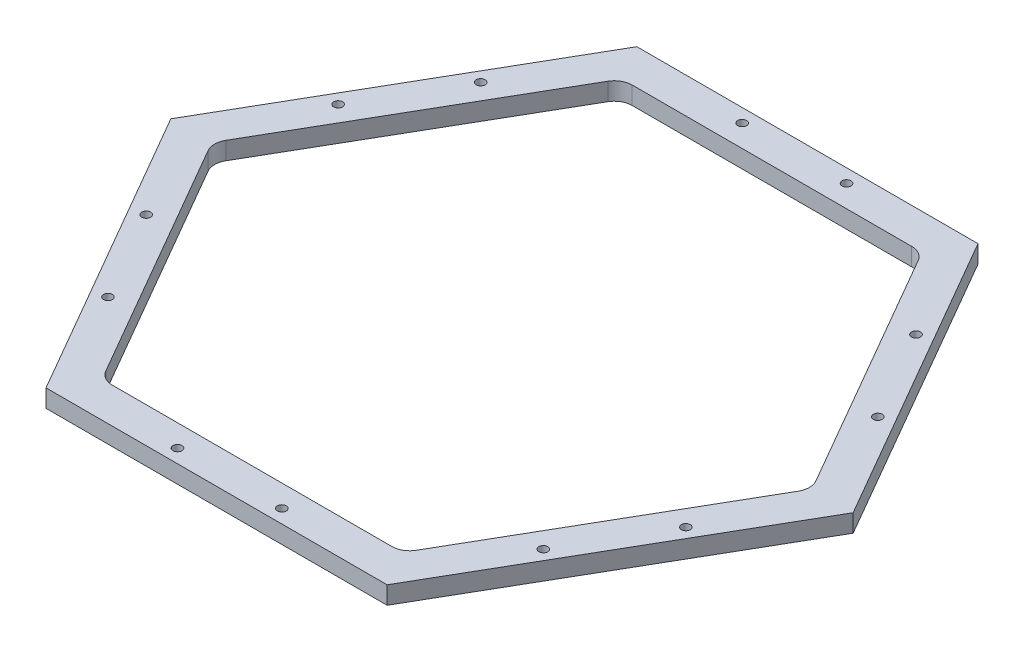
ISO-10303-21;
HEADER;
FILE_DESCRIPTION(('STEP AP214'),'2;1');
FILE_NAME('part.step','',(''),(''),'','','');
FILE_SCHEMA(('AUTOMOTIVE_DESIGN { 1 0 10303 214 1 1 1 1 }'));
ENDSEC;
DATA;
#1=APPLICATION_CONTEXT('core data for automotive mechanical design processes');
#2=APPLICATION_PROTOCOL_DEFINITION('international standard','automotive_design',2000,#1);
#3=PRODUCT_CONTEXT('',#1,'mechanical');
#4=PRODUCT('Part','Part','',(#3));
#5=PRODUCT_RELATED_PRODUCT_CATEGORY('part','',(#4));
#6=PRODUCT_DEFINITION_FORMATION('','',#4);
#7=PRODUCT_DEFINITION_CONTEXT('part definition',#1,'design');
#8=PRODUCT_DEFINITION('design','',#6,#7);
#9=PRODUCT_DEFINITION_SHAPE('','',#8);
#10=(LENGTH_UNIT() NAMED_UNIT(*) SI_UNIT(.MILLI.,.METRE.));
#11=(NAMED_UNIT(*) PLANE_ANGLE_UNIT() SI_UNIT($,.RADIAN.));
#12=(NAMED_UNIT(*) SI_UNIT($,.STERADIAN.) SOLID_ANGLE_UNIT());
#13=UNCERTAINTY_MEASURE_WITH_UNIT(LENGTH_MEASURE(1.E-05),#10,'distance_accuracy_value','');
#14=(GEOMETRIC_REPRESENTATION_CONTEXT(3) GLOBAL_UNCERTAINTY_ASSIGNED_CONTEXT((#13)) GLOBAL_UNIT_ASSIGNED_CONTEXT((#10,
#11,#12)) REPRESENTATION_CONTEXT('',''));
#15=CARTESIAN_POINT('',(0.,0.,0.));
#16=DIRECTION('',(0.,0.,1.));
#17=DIRECTION('',(1.,0.,0.));
#18=AXIS2_PLACEMENT_3D('',#15,#16,#17);
#19=CARTESIAN_POINT('',(0.,3.175,0.));
#20=DIRECTION('',(0.,1.,0.));
#21=DIRECTION('',(0.,0.,1.));
#22=AXIS2_PLACEMENT_3D('',#19,#20,#21);
#23=PLANE('',#22);
#24=CARTESIAN_POINT('',(-38.9523593293957,3.175,-33.353004394834));
#25=DIRECTION('',(0.,1.,0.));
#26=DIRECTION('',(0.,0.,1.));
#27=AXIS2_PLACEMENT_3D('',#24,#25,#26);
#28=CIRCLE('',#27,0.799999999999988);
#29=CARTESIAN_POINT('',(-38.9523593293957,3.175,-32.5530043948341));
#30=VERTEX_POINT('',#29);
#31=EDGE_CURVE('E329',#30,#30,#28,.T.);
#32=ORIENTED_EDGE('',*,*,#31,.F.);
#33=EDGE_LOOP('',(#32));
#34=FACE_BOUND('',#33,.T.);
#35=CARTESIAN_POINT('',(-48.2837120382008,3.175,-17.1906273998387));
#36=DIRECTION('',(0.,1.,0.));
#37=DIRECTION('',(0.,0.,1.));
#38=AXIS2_PLACEMENT_3D('',#35,#36,#37);
#39=CIRCLE('',#38,0.799999999999988);
#40=CARTESIAN_POINT('',(-48.2837120382008,3.175,-16.3906273998387));
#41=VERTEX_POINT('',#40);
#42=EDGE_CURVE('E319',#41,#41,#39,.T.);
#43=ORIENTED_EDGE('',*,*,#42,.F.);
#44=EDGE_LOOP('',(#43));
#45=FACE_BOUND('',#44,.T.);
#46=CARTESIAN_POINT('',(-48.3607287631581,3.175,17.0572305191795));
#47=DIRECTION('',(0.,1.,0.));
#48=DIRECTION('',(0.,0.,1.));
#49=AXIS2_PLACEMENT_3D('',#46,#47,#48);
#50=CIRCLE('',#49,0.799999999999988);
#51=CARTESIAN_POINT('',(-48.3607287631581,3.175,17.8572305191795));
#52=VERTEX_POINT('',#51);
#53=EDGE_CURVE('E316',#52,#52,#50,.T.);
#54=ORIENTED_EDGE('',*,*,#53,.F.);
#55=EDGE_LOOP('',(#54));
#56=FACE_BOUND('',#55,.T.);
#57=CARTESIAN_POINT('',(-39.0293760543535,3.175,33.2196075141752));
#58=DIRECTION('',(0.,1.,0.));
#59=DIRECTION('',(0.,0.,1.));
#60=AXIS2_PLACEMENT_3D('',#57,#58,#59);
#61=CIRCLE('',#60,0.799999999999988);
#62=CARTESIAN_POINT('',(-39.0293760543535,3.175,34.0196075141751));
#63=VERTEX_POINT('',#62);
#64=EDGE_CURVE('E313',#63,#63,#61,.T.);
#65=ORIENTED_EDGE('',*,*,#64,.F.);
#66=EDGE_LOOP('',(#65));
#67=FACE_BOUND('',#66,.T.);
#68=CARTESIAN_POINT('',(-9.4083694337619,3.175,50.4102349140136));
#69=DIRECTION('',(0.,1.,0.));
#70=DIRECTION('',(0.,0.,1.));
#71=AXIS2_PLACEMENT_3D('',#68,#69,#70);
#72=CIRCLE('',#71,0.79999999999999);
#73=CARTESIAN_POINT('',(-9.4083694337619,3.175,51.2102349140135));
#74=VERTEX_POINT('',#73);
#75=EDGE_CURVE('E309',#74,#74,#72,.T.);
#76=ORIENTED_EDGE('',*,*,#75,.F.);
#77=EDGE_LOOP('',(#76));
#78=FACE_BOUND('',#77,.T.);
#79=CARTESIAN_POINT('',(9.25433598384783,3.175,50.4102349140137));
#80=DIRECTION('',(0.,1.,0.));
#81=DIRECTION('',(0.,0.,1.));
#82=AXIS2_PLACEMENT_3D('',#79,#80,#81);
#83=CIRCLE('',#82,0.79999999999999);
#84=CARTESIAN_POINT('',(9.25433598384783,3.175,51.2102349140137));
#85=VERTEX_POINT('',#84);
#86=EDGE_CURVE('E305',#85,#85,#83,.T.);
#87=ORIENTED_EDGE('',*,*,#86,.F.);
#88=EDGE_LOOP('',(#87));
#89=FACE_BOUND('',#88,.T.);
#90=CARTESIAN_POINT('',(38.9523593293959,3.175,33.3530043948338));
#91=DIRECTION('',(0.,1.,0.));
#92=DIRECTION('',(0.,0.,1.));
#93=AXIS2_PLACEMENT_3D('',#90,#91,#92);
#94=CIRCLE('',#93,0.799999999999988);
#95=CARTESIAN_POINT('',(38.9523593293959,3.175,34.1530043948338));
#96=VERTEX_POINT('',#95);
#97=EDGE_CURVE('E304',#96,#96,#94,.T.);
#98=ORIENTED_EDGE('',*,*,#97,.F.);
#99=EDGE_LOOP('',(#98));
#100=FACE_BOUND('',#99,.T.);
#101=CARTESIAN_POINT('',(48.283712038201,3.175,17.1906273998384));
#102=DIRECTION('',(0.,1.,0.));
#103=DIRECTION('',(0.,0.,1.));
#104=AXIS2_PLACEMENT_3D('',#101,#102,#103);
#105=CIRCLE('',#104,0.799999999999988);
#106=CARTESIAN_POINT('',(48.283712038201,3.175,17.9906273998384));
#107=VERTEX_POINT('',#106);
#108=EDGE_CURVE('E343',#107,#107,#105,.T.);
#109=ORIENTED_EDGE('',*,*,#108,.F.);
#110=EDGE_LOOP('',(#109));
#111=FACE_BOUND('',#110,.T.);
#112=CARTESIAN_POINT('',(48.360728763158,3.175,-17.0572305191798));
#113=DIRECTION('',(0.,1.,0.));
#114=DIRECTION('',(0.,0.,1.));
#115=AXIS2_PLACEMENT_3D('',#112,#113,#114);
#116=CIRCLE('',#115,0.799999999999988);
#117=CARTESIAN_POINT('',(48.360728763158,3.175,-16.2572305191799));
#118=VERTEX_POINT('',#117);
#119=EDGE_CURVE('E300',#118,#118,#116,.T.);
#120=ORIENTED_EDGE('',*,*,#119,.F.);
#121=EDGE_LOOP('',(#120));
#122=FACE_BOUND('',#121,.T.);
#123=CARTESIAN_POINT('',(39.0293760543533,3.175,-33.2196075141754));
#124=DIRECTION('',(0.,1.,0.));
#125=DIRECTION('',(0.,0.,1.));
#126=AXIS2_PLACEMENT_3D('',#123,#124,#125);
#127=CIRCLE('',#126,0.799999999999988);
#128=CARTESIAN_POINT('',(39.0293760543533,3.175,-32.4196075141754));
#129=VERTEX_POINT('',#128);
#130=EDGE_CURVE('E299',#129,#129,#127,.T.);
#131=ORIENTED_EDGE('',*,*,#130,.F.);
#132=EDGE_LOOP('',(#131));
#133=FACE_BOUND('',#132,.T.);
#134=CARTESIAN_POINT('',(9.4083694337619,3.175,-50.4102349140136));
#135=DIRECTION('',(0.,1.,0.));
#136=DIRECTION('',(0.,0.,1.));
#137=AXIS2_PLACEMENT_3D('',#134,#135,#136);
#138=CIRCLE('',#137,0.79999999999999);
#139=CARTESIAN_POINT('',(9.4083694337619,3.175,-49.6102349140136));
#140=VERTEX_POINT('',#139);
#141=EDGE_CURVE('E356',#140,#140,#138,.T.);
#142=ORIENTED_EDGE('',*,*,#141,.F.);
#143=EDGE_LOOP('',(#142));
#144=FACE_BOUND('',#143,.T.);
#145=CARTESIAN_POINT('',(-9.25433598384783,3.175,-50.4102349140137));
#146=DIRECTION('',(0.,1.,0.));
#147=DIRECTION('',(0.,0.,1.));
#148=AXIS2_PLACEMENT_3D('',#145,#146,#147);
#149=CIRCLE('',#148,0.79999999999999);
#150=CARTESIAN_POINT('',(-9.25433598384783,3.175,-49.6102349140137));
#151=VERTEX_POINT('',#150);
#152=EDGE_CURVE('E362',#151,#151,#149,.T.);
#153=ORIENTED_EDGE('',*,*,#152,.F.);
#154=EDGE_LOOP('',(#153));
#155=FACE_BOUND('',#154,.T.);
#156=DIRECTION('',(0.5,0.,-0.866025403784438));
#157=VECTOR('',#156,1.);
#158=CARTESIAN_POINT('',(30.4992613140312,3.175,52.8262701892219));
#159=LINE('',#158,#157);
#160=CARTESIAN_POINT('',(30.4992613140312,3.175,52.8262701892219));
#161=VERTEX_POINT('',#160);
#162=CARTESIAN_POINT('',(60.9985226280624,3.175,0.));
#163=VERTEX_POINT('',#162);
#164=EDGE_CURVE('E257',#161,#163,#159,.T.);
#165=ORIENTED_EDGE('',*,*,#164,.T.);
#166=DIRECTION('',(-0.5,0.,-0.866025403784439));
#167=VECTOR('',#166,1.);
#168=CARTESIAN_POINT('',(60.9985226280624,3.175,0.));
#169=LINE('',#168,#167);
#170=CARTESIAN_POINT('',(30.4992613140312,3.175,-52.8262701892219));
#171=VERTEX_POINT('',#170);
#172=EDGE_CURVE('E260',#163,#171,#169,.T.);
#173=ORIENTED_EDGE('',*,*,#172,.T.);
#174=DIRECTION('',(-1.,0.,0.));
#175=VECTOR('',#174,1.);
#176=CARTESIAN_POINT('',(30.4992613140312,3.175,-52.8262701892219));
#177=LINE('',#176,#175);
#178=CARTESIAN_POINT('',(-30.4992613140312,3.175,-52.8262701892219));
#179=VERTEX_POINT('',#178);
#180=EDGE_CURVE('E263',#171,#179,#177,.T.);
#181=ORIENTED_EDGE('',*,*,#180,.T.);
#182=DIRECTION('',(-0.5,0.,0.866025403784439));
#183=VECTOR('',#182,1.);
#184=CARTESIAN_POINT('',(-30.4992613140312,3.175,-52.8262701892219));
#185=LINE('',#184,#183);
#186=CARTESIAN_POINT('',(-60.9985226280624,3.175,0.));
#187=VERTEX_POINT('',#186);
#188=EDGE_CURVE('E265',#179,#187,#185,.T.);
#189=ORIENTED_EDGE('',*,*,#188,.T.);
#190=DIRECTION('',(0.5,0.,0.866025403784438));
#191=VECTOR('',#190,1.);
#192=CARTESIAN_POINT('',(-60.9985226280624,3.175,0.));
#193=LINE('',#192,#191);
#194=CARTESIAN_POINT('',(-30.4992613140312,3.175,52.8262701892219));
#195=VERTEX_POINT('',#194);
#196=EDGE_CURVE('E267',#187,#195,#193,.T.);
#197=ORIENTED_EDGE('',*,*,#196,.T.);
#198=DIRECTION('',(1.,0.,0.));
#199=VECTOR('',#198,1.);
#200=CARTESIAN_POINT('',(-30.4992613140312,3.175,52.8262701892219));
#201=LINE('',#200,#199);
#202=EDGE_CURVE('E269',#195,#161,#201,.T.);
#203=ORIENTED_EDGE('',*,*,#202,.T.);
#204=EDGE_LOOP('',(#165,#173,#181,#189,#197,#203));
#205=FACE_BOUND('',#204,.T.);
#206=DIRECTION('',(0.5,0.,0.866025403784438));
#207=VECTOR('',#206,1.);
#208=CARTESIAN_POINT('',(-52.7496306570156,3.175,1.58750000000003));
#209=LINE('',#208,#207);
#210=CARTESIAN_POINT('',(-52.7496306570156,3.175,1.58750000000003));
#211=VERTEX_POINT('',#210);
#212=CARTESIAN_POINT('',(-27.7496306570156,3.175,44.8887701892219));
#213=VERTEX_POINT('',#212);
#214=EDGE_CURVE('E170',#211,#213,#209,.T.);
#215=ORIENTED_EDGE('',*,*,#214,.F.);
#216=CARTESIAN_POINT('',(-50.,3.175,0.));
#217=DIRECTION('',(0.,1.,0.));
#218=DIRECTION('',(0.,0.,1.));
#219=AXIS2_PLACEMENT_3D('',#216,#217,#218);
#220=CIRCLE('',#219,3.17500000000001);
#221=CARTESIAN_POINT('',(-52.7496306570156,3.175,-1.58749999999998));
#222=VERTEX_POINT('',#221);
#223=EDGE_CURVE('E162',#222,#211,#220,.T.);
#224=ORIENTED_EDGE('',*,*,#223,.F.);
#225=DIRECTION('',(-0.5,0.,0.866025403784439));
#226=VECTOR('',#225,1.);
#227=CARTESIAN_POINT('',(-27.7496306570156,3.175,-44.8887701892219));
#228=LINE('',#227,#226);
#229=CARTESIAN_POINT('',(-27.7496306570156,3.175,-44.8887701892219));
#230=VERTEX_POINT('',#229);
#231=EDGE_CURVE('E204',#230,#222,#228,.T.);
#232=ORIENTED_EDGE('',*,*,#231,.F.);
#233=CARTESIAN_POINT('',(-25.,3.175,-43.3012701892219));
#234=DIRECTION('',(0.,1.,0.));
#235=DIRECTION('',(0.,0.,1.));
#236=AXIS2_PLACEMENT_3D('',#233,#234,#235);
#237=CIRCLE('',#236,3.175);
#238=CARTESIAN_POINT('',(-25.,3.175,-46.4762701892219));
#239=VERTEX_POINT('',#238);
#240=EDGE_CURVE('E202',#239,#230,#237,.T.);
#241=ORIENTED_EDGE('',*,*,#240,.F.);
#242=DIRECTION('',(-1.,0.,0.));
#243=VECTOR('',#242,1.);
#244=CARTESIAN_POINT('',(25.,3.175,-46.4762701892219));
#245=LINE('',#244,#243);
#246=CARTESIAN_POINT('',(25.,3.175,-46.4762701892219));
#247=VERTEX_POINT('',#246);
#248=EDGE_CURVE('E200',#247,#239,#245,.T.);
#249=ORIENTED_EDGE('',*,*,#248,.F.);
#250=CARTESIAN_POINT('',(25.,3.175,-43.3012701892219));
#251=DIRECTION('',(0.,1.,0.));
#252=DIRECTION('',(0.,0.,1.));
#253=AXIS2_PLACEMENT_3D('',#250,#251,#252);
#254=CIRCLE('',#253,3.175);
#255=CARTESIAN_POINT('',(27.7496306570156,3.175,-44.8887701892219));
#256=VERTEX_POINT('',#255);
#257=EDGE_CURVE('E198',#256,#247,#254,.T.);
#258=ORIENTED_EDGE('',*,*,#257,.F.);
#259=DIRECTION('',(-0.5,0.,-0.866025403784439));
#260=VECTOR('',#259,1.);
#261=CARTESIAN_POINT('',(52.7496306570156,3.175,-1.58750000000003));
#262=LINE('',#261,#260);
#263=CARTESIAN_POINT('',(52.7496306570156,3.175,-1.58750000000003));
#264=VERTEX_POINT('',#263);
#265=EDGE_CURVE('E196',#264,#256,#262,.T.);
#266=ORIENTED_EDGE('',*,*,#265,.F.);
#267=CARTESIAN_POINT('',(50.,3.175,0.));
#268=DIRECTION('',(0.,1.,0.));
#269=DIRECTION('',(0.,0.,-1.));
#270=AXIS2_PLACEMENT_3D('',#267,#268,#269);
#271=CIRCLE('',#270,3.175);
#272=CARTESIAN_POINT('',(52.7496306570156,3.175,1.58749999999997));
#273=VERTEX_POINT('',#272);
#274=EDGE_CURVE('E194',#273,#264,#271,.T.);
#275=ORIENTED_EDGE('',*,*,#274,.F.);
#276=DIRECTION('',(0.5,0.,-0.866025403784439));
#277=VECTOR('',#276,1.);
#278=CARTESIAN_POINT('',(27.7496306570156,3.175,44.8887701892219));
#279=LINE('',#278,#277);
#280=CARTESIAN_POINT('',(27.7496306570156,3.175,44.8887701892219));
#281=VERTEX_POINT('',#280);
#282=EDGE_CURVE('E192',#281,#273,#279,.T.);
#283=ORIENTED_EDGE('',*,*,#282,.F.);
#284=CARTESIAN_POINT('',(25.,3.175,43.3012701892219));
#285=DIRECTION('',(0.,1.,0.));
#286=DIRECTION('',(0.,0.,1.));
#287=AXIS2_PLACEMENT_3D('',#284,#285,#286);
#288=CIRCLE('',#287,3.175);
#289=CARTESIAN_POINT('',(25.,3.175,46.4762701892219));
#290=VERTEX_POINT('',#289);
#291=EDGE_CURVE('E190',#290,#281,#288,.T.);
#292=ORIENTED_EDGE('',*,*,#291,.F.);
#293=DIRECTION('',(1.,0.,0.));
#294=VECTOR('',#293,1.);
#295=CARTESIAN_POINT('',(-25.,3.175,46.4762701892219));
#296=LINE('',#295,#294);
#297=CARTESIAN_POINT('',(-25.,3.175,46.4762701892219));
#298=VERTEX_POINT('',#297);
#299=EDGE_CURVE('E185',#298,#290,#296,.T.);
#300=ORIENTED_EDGE('',*,*,#299,.F.);
#301=CARTESIAN_POINT('',(-25.,3.175,43.3012701892219));
#302=DIRECTION('',(0.,1.,0.));
#303=DIRECTION('',(0.,0.,1.));
#304=AXIS2_PLACEMENT_3D('',#301,#302,#303);
#305=CIRCLE('',#304,3.175);
#306=EDGE_CURVE('E183',#213,#298,#305,.T.);
#307=ORIENTED_EDGE('',*,*,#306,.F.);
#308=EDGE_LOOP('',(#215,#224,#232,#241,#249,#258,#266,#275,#283,#292,#300,#307));
#309=FACE_BOUND('',#308,.T.);
#310=ADVANCED_FACE('F35',(#34,#45,#56,#67,#78,#89,#100,#111,#122,#133,#144,#155,#205,#309),#23,.T.);
#311=CARTESIAN_POINT('',(0.,0.,0.));
#312=DIRECTION('',(0.,1.,0.));
#313=DIRECTION('',(0.,0.,1.));
#314=AXIS2_PLACEMENT_3D('',#311,#312,#313);
#315=PLANE('',#314);
#316=CARTESIAN_POINT('',(-38.9523593293957,0.,-33.353004394834));
#317=DIRECTION('',(0.,1.,0.));
#318=DIRECTION('',(0.,0.,1.));
#319=AXIS2_PLACEMENT_3D('',#316,#317,#318);
#320=CIRCLE('',#319,0.799999999999988);
#321=CARTESIAN_POINT('',(-38.9523593293957,0.,-32.5530043948341));
#322=VERTEX_POINT('',#321);
#323=EDGE_CURVE('E39',#322,#322,#320,.T.);
#324=ORIENTED_EDGE('',*,*,#323,.T.);
#325=EDGE_LOOP('',(#324));
#326=FACE_BOUND('',#325,.T.);
#327=CARTESIAN_POINT('',(-48.2837120382008,0.,-17.1906273998387));
#328=DIRECTION('',(0.,1.,0.));
#329=DIRECTION('',(0.,0.,1.));
#330=AXIS2_PLACEMENT_3D('',#327,#328,#329);
#331=CIRCLE('',#330,0.799999999999988);
#332=CARTESIAN_POINT('',(-48.2837120382008,0.,-16.3906273998387));
#333=VERTEX_POINT('',#332);
#334=EDGE_CURVE('E317',#333,#333,#331,.T.);
#335=ORIENTED_EDGE('',*,*,#334,.T.);
#336=EDGE_LOOP('',(#335));
#337=FACE_BOUND('',#336,.T.);
#338=CARTESIAN_POINT('',(-48.3607287631581,0.,17.0572305191795));
#339=DIRECTION('',(0.,1.,0.));
#340=DIRECTION('',(0.,0.,1.));
#341=AXIS2_PLACEMENT_3D('',#338,#339,#340);
#342=CIRCLE('',#341,0.799999999999988);
#343=CARTESIAN_POINT('',(-48.3607287631581,0.,17.8572305191795));
#344=VERTEX_POINT('',#343);
#345=EDGE_CURVE('E314',#344,#344,#342,.T.);
#346=ORIENTED_EDGE('',*,*,#345,.T.);
#347=EDGE_LOOP('',(#346));
#348=FACE_BOUND('',#347,.T.);
#349=CARTESIAN_POINT('',(-39.0293760543535,0.,33.2196075141752));
#350=DIRECTION('',(0.,1.,0.));
#351=DIRECTION('',(0.,0.,1.));
#352=AXIS2_PLACEMENT_3D('',#349,#350,#351);
#353=CIRCLE('',#352,0.799999999999988);
#354=CARTESIAN_POINT('',(-39.0293760543535,0.,34.0196075141751));
#355=VERTEX_POINT('',#354);
#356=EDGE_CURVE('E310',#355,#355,#353,.T.);
#357=ORIENTED_EDGE('',*,*,#356,.T.);
#358=EDGE_LOOP('',(#357));
#359=FACE_BOUND('',#358,.T.);
#360=CARTESIAN_POINT('',(-9.4083694337619,0.,50.4102349140136));
#361=DIRECTION('',(0.,1.,0.));
#362=DIRECTION('',(0.,0.,1.));
#363=AXIS2_PLACEMENT_3D('',#360,#361,#362);
#364=CIRCLE('',#363,0.799999999999989);
#365=CARTESIAN_POINT('',(-9.4083694337619,0.,51.2102349140135));
#366=VERTEX_POINT('',#365);
#367=EDGE_CURVE('E306',#366,#366,#364,.T.);
#368=ORIENTED_EDGE('',*,*,#367,.T.);
#369=EDGE_LOOP('',(#368));
#370=FACE_BOUND('',#369,.T.);
#371=CARTESIAN_POINT('',(9.25433598384783,0.,50.4102349140137));
#372=DIRECTION('',(0.,1.,0.));
#373=DIRECTION('',(0.,0.,1.));
#374=AXIS2_PLACEMENT_3D('',#371,#372,#373);
#375=CIRCLE('',#374,0.799999999999989);
#376=CARTESIAN_POINT('',(9.25433598384783,0.,51.2102349140137));
#377=VERTEX_POINT('',#376);
#378=EDGE_CURVE('E301',#377,#377,#375,.T.);
#379=ORIENTED_EDGE('',*,*,#378,.T.);
#380=EDGE_LOOP('',(#379));
#381=FACE_BOUND('',#380,.T.);
#382=CARTESIAN_POINT('',(38.9523593293959,0.,33.3530043948338));
#383=DIRECTION('',(0.,1.,0.));
#384=DIRECTION('',(0.,0.,1.));
#385=AXIS2_PLACEMENT_3D('',#382,#383,#384);
#386=CIRCLE('',#385,0.799999999999988);
#387=CARTESIAN_POINT('',(38.9523593293959,0.,34.1530043948338));
#388=VERTEX_POINT('',#387);
#389=EDGE_CURVE('E340',#388,#388,#386,.T.);
#390=ORIENTED_EDGE('',*,*,#389,.T.);
#391=EDGE_LOOP('',(#390));
#392=FACE_BOUND('',#391,.T.);
#393=CARTESIAN_POINT('',(48.283712038201,0.,17.1906273998384));
#394=DIRECTION('',(0.,1.,0.));
#395=DIRECTION('',(0.,0.,1.));
#396=AXIS2_PLACEMENT_3D('',#393,#394,#395);
#397=CIRCLE('',#396,0.799999999999988);
#398=CARTESIAN_POINT('',(48.283712038201,0.,17.9906273998384));
#399=VERTEX_POINT('',#398);
#400=EDGE_CURVE('E346',#399,#399,#397,.T.);
#401=ORIENTED_EDGE('',*,*,#400,.T.);
#402=EDGE_LOOP('',(#401));
#403=FACE_BOUND('',#402,.T.);
#404=CARTESIAN_POINT('',(48.360728763158,0.,-17.0572305191798));
#405=DIRECTION('',(0.,1.,0.));
#406=DIRECTION('',(0.,0.,1.));
#407=AXIS2_PLACEMENT_3D('',#404,#405,#406);
#408=CIRCLE('',#407,0.799999999999988);
#409=CARTESIAN_POINT('',(48.360728763158,0.,-16.2572305191799));
#410=VERTEX_POINT('',#409);
#411=EDGE_CURVE('E296',#410,#410,#408,.T.);
#412=ORIENTED_EDGE('',*,*,#411,.T.);
#413=EDGE_LOOP('',(#412));
#414=FACE_BOUND('',#413,.T.);
#415=CARTESIAN_POINT('',(39.0293760543533,0.,-33.2196075141754));
#416=DIRECTION('',(0.,1.,0.));
#417=DIRECTION('',(0.,0.,1.));
#418=AXIS2_PLACEMENT_3D('',#415,#416,#417);
#419=CIRCLE('',#418,0.799999999999988);
#420=CARTESIAN_POINT('',(39.0293760543533,0.,-32.4196075141754));
#421=VERTEX_POINT('',#420);
#422=EDGE_CURVE('E353',#421,#421,#419,.T.);
#423=ORIENTED_EDGE('',*,*,#422,.T.);
#424=EDGE_LOOP('',(#423));
#425=FACE_BOUND('',#424,.T.);
#426=CARTESIAN_POINT('',(9.4083694337619,0.,-50.4102349140136));
#427=DIRECTION('',(0.,1.,0.));
#428=DIRECTION('',(0.,0.,1.));
#429=AXIS2_PLACEMENT_3D('',#426,#427,#428);
#430=CIRCLE('',#429,0.799999999999989);
#431=CARTESIAN_POINT('',(9.4083694337619,0.,-49.6102349140136));
#432=VERTEX_POINT('',#431);
#433=EDGE_CURVE('E359',#432,#432,#430,.T.);
#434=ORIENTED_EDGE('',*,*,#433,.T.);
#435=EDGE_LOOP('',(#434));
#436=FACE_BOUND('',#435,.T.);
#437=CARTESIAN_POINT('',(-9.25433598384783,0.,-50.4102349140137));
#438=DIRECTION('',(0.,1.,0.));
#439=DIRECTION('',(0.,0.,1.));
#440=AXIS2_PLACEMENT_3D('',#437,#438,#439);
#441=CIRCLE('',#440,0.799999999999989);
#442=CARTESIAN_POINT('',(-9.25433598384783,0.,-49.6102349140137));
#443=VERTEX_POINT('',#442);
#444=EDGE_CURVE('E207',#443,#443,#441,.T.);
#445=ORIENTED_EDGE('',*,*,#444,.T.);
#446=EDGE_LOOP('',(#445));
#447=FACE_BOUND('',#446,.T.);
#448=DIRECTION('',(0.5,0.,-0.866025403784438));
#449=VECTOR('',#448,1.);
#450=CARTESIAN_POINT('',(30.4992613140312,0.,52.8262701892219));
#451=LINE('',#450,#449);
#452=CARTESIAN_POINT('',(30.4992613140312,0.,52.8262701892219));
#453=VERTEX_POINT('',#452);
#454=CARTESIAN_POINT('',(60.9985226280624,0.,0.));
#455=VERTEX_POINT('',#454);
#456=EDGE_CURVE('E178',#453,#455,#451,.T.);
#457=ORIENTED_EDGE('',*,*,#456,.F.);
#458=DIRECTION('',(1.,0.,0.));
#459=VECTOR('',#458,1.);
#460=CARTESIAN_POINT('',(-30.4992613140312,0.,52.8262701892219));
#461=LINE('',#460,#459);
#462=CARTESIAN_POINT('',(-30.4992613140312,0.,52.8262701892219));
#463=VERTEX_POINT('',#462);
#464=EDGE_CURVE('E261',#463,#453,#461,.T.);
#465=ORIENTED_EDGE('',*,*,#464,.F.);
#466=DIRECTION('',(0.5,0.,0.866025403784438));
#467=VECTOR('',#466,1.);
#468=CARTESIAN_POINT('',(-60.9985226280624,0.,0.));
#469=LINE('',#468,#467);
#470=CARTESIAN_POINT('',(-60.9985226280624,0.,0.));
#471=VERTEX_POINT('',#470);
#472=EDGE_CURVE('E280',#471,#463,#469,.T.);
#473=ORIENTED_EDGE('',*,*,#472,.F.);
#474=DIRECTION('',(-0.5,0.,0.866025403784439));
#475=VECTOR('',#474,1.);
#476=CARTESIAN_POINT('',(-30.4992613140312,0.,-52.8262701892219));
#477=LINE('',#476,#475);
#478=CARTESIAN_POINT('',(-30.4992613140312,0.,-52.8262701892219));
#479=VERTEX_POINT('',#478);
#480=EDGE_CURVE('E278',#479,#471,#477,.T.);
#481=ORIENTED_EDGE('',*,*,#480,.F.);
#482=DIRECTION('',(-1.,0.,0.));
#483=VECTOR('',#482,1.);
#484=CARTESIAN_POINT('',(30.4992613140312,0.,-52.8262701892219));
#485=LINE('',#484,#483);
#486=CARTESIAN_POINT('',(30.4992613140312,0.,-52.8262701892219));
#487=VERTEX_POINT('',#486);
#488=EDGE_CURVE('E276',#487,#479,#485,.T.);
#489=ORIENTED_EDGE('',*,*,#488,.F.);
#490=DIRECTION('',(-0.5,0.,-0.866025403784439));
#491=VECTOR('',#490,1.);
#492=CARTESIAN_POINT('',(60.9985226280624,0.,0.));
#493=LINE('',#492,#491);
#494=EDGE_CURVE('E274',#455,#487,#493,.T.);
#495=ORIENTED_EDGE('',*,*,#494,.F.);
#496=EDGE_LOOP('',(#457,#465,#473,#481,#489,#495));
#497=FACE_BOUND('',#496,.T.);
#498=CARTESIAN_POINT('',(-50.,0.,0.));
#499=DIRECTION('',(0.,1.,0.));
#500=DIRECTION('',(0.,0.,1.));
#501=AXIS2_PLACEMENT_3D('',#498,#499,#500);
#502=CIRCLE('',#501,3.17500000000001);
#503=CARTESIAN_POINT('',(-52.7496306570156,0.,-1.58749999999998));
#504=VERTEX_POINT('',#503);
#505=CARTESIAN_POINT('',(-52.7496306570156,0.,1.58750000000003));
#506=VERTEX_POINT('',#505);
#507=EDGE_CURVE('E60',#504,#506,#502,.T.);
#508=ORIENTED_EDGE('',*,*,#507,.T.);
#509=DIRECTION('',(0.5,0.,0.866025403784438));
#510=VECTOR('',#509,1.);
#511=CARTESIAN_POINT('',(-52.7496306570156,0.,1.58750000000003));
#512=LINE('',#511,#510);
#513=CARTESIAN_POINT('',(-27.7496306570156,0.,44.8887701892219));
#514=VERTEX_POINT('',#513);
#515=EDGE_CURVE('E177',#506,#514,#512,.T.);
#516=ORIENTED_EDGE('',*,*,#515,.T.);
#517=CARTESIAN_POINT('',(-25.,0.,43.3012701892219));
#518=DIRECTION('',(0.,1.,0.));
#519=DIRECTION('',(0.,0.,1.));
#520=AXIS2_PLACEMENT_3D('',#517,#518,#519);
#521=CIRCLE('',#520,3.175);
#522=CARTESIAN_POINT('',(-25.,0.,46.4762701892219));
#523=VERTEX_POINT('',#522);
#524=EDGE_CURVE('E209',#514,#523,#521,.T.);
#525=ORIENTED_EDGE('',*,*,#524,.T.);
#526=DIRECTION('',(1.,0.,0.));
#527=VECTOR('',#526,1.);
#528=CARTESIAN_POINT('',(-25.,0.,46.4762701892219));
#529=LINE('',#528,#527);
#530=CARTESIAN_POINT('',(25.,0.,46.4762701892219));
#531=VERTEX_POINT('',#530);
#532=EDGE_CURVE('E212',#523,#531,#529,.T.);
#533=ORIENTED_EDGE('',*,*,#532,.T.);
#534=CARTESIAN_POINT('',(25.,0.,43.3012701892219));
#535=DIRECTION('',(0.,1.,0.));
#536=DIRECTION('',(0.,0.,1.));
#537=AXIS2_PLACEMENT_3D('',#534,#535,#536);
#538=CIRCLE('',#537,3.175);
#539=CARTESIAN_POINT('',(27.7496306570156,0.,44.8887701892219));
#540=VERTEX_POINT('',#539);
#541=EDGE_CURVE('E215',#531,#540,#538,.T.);
#542=ORIENTED_EDGE('',*,*,#541,.T.);
#543=DIRECTION('',(0.5,0.,-0.866025403784439));
#544=VECTOR('',#543,1.);
#545=CARTESIAN_POINT('',(27.7496306570156,0.,44.8887701892219));
#546=LINE('',#545,#544);
#547=CARTESIAN_POINT('',(52.7496306570156,0.,1.58749999999997));
#548=VERTEX_POINT('',#547);
#549=EDGE_CURVE('E218',#540,#548,#546,.T.);
#550=ORIENTED_EDGE('',*,*,#549,.T.);
#551=CARTESIAN_POINT('',(50.,0.,0.));
#552=DIRECTION('',(0.,1.,0.));
#553=DIRECTION('',(0.,0.,-1.));
#554=AXIS2_PLACEMENT_3D('',#551,#552,#553);
#555=CIRCLE('',#554,3.175);
#556=CARTESIAN_POINT('',(52.7496306570156,0.,-1.58750000000003));
#557=VERTEX_POINT('',#556);
#558=EDGE_CURVE('E221',#548,#557,#555,.T.);
#559=ORIENTED_EDGE('',*,*,#558,.T.);
#560=DIRECTION('',(-0.5,0.,-0.866025403784439));
#561=VECTOR('',#560,1.);
#562=CARTESIAN_POINT('',(52.7496306570156,0.,-1.58750000000003));
#563=LINE('',#562,#561);
#564=CARTESIAN_POINT('',(27.7496306570156,0.,-44.8887701892219));
#565=VERTEX_POINT('',#564);
#566=EDGE_CURVE('E224',#557,#565,#563,.T.);
#567=ORIENTED_EDGE('',*,*,#566,.T.);
#568=CARTESIAN_POINT('',(25.,0.,-43.3012701892219));
#569=DIRECTION('',(0.,1.,0.));
#570=DIRECTION('',(0.,0.,1.));
#571=AXIS2_PLACEMENT_3D('',#568,#569,#570);
#572=CIRCLE('',#571,3.175);
#573=CARTESIAN_POINT('',(25.,0.,-46.4762701892219));
#574=VERTEX_POINT('',#573);
#575=EDGE_CURVE('E227',#565,#574,#572,.T.);
#576=ORIENTED_EDGE('',*,*,#575,.T.);
#577=DIRECTION('',(-1.,0.,0.));
#578=VECTOR('',#577,1.);
#579=CARTESIAN_POINT('',(25.,0.,-46.4762701892219));
#580=LINE('',#579,#578);
#581=CARTESIAN_POINT('',(-25.,0.,-46.4762701892219));
#582=VERTEX_POINT('',#581);
#583=EDGE_CURVE('E230',#574,#582,#580,.T.);
#584=ORIENTED_EDGE('',*,*,#583,.T.);
#585=CARTESIAN_POINT('',(-25.,0.,-43.3012701892219));
#586=DIRECTION('',(0.,1.,0.));
#587=DIRECTION('',(0.,0.,1.));
#588=AXIS2_PLACEMENT_3D('',#585,#586,#587);
#589=CIRCLE('',#588,3.175);
#590=CARTESIAN_POINT('',(-27.7496306570156,0.,-44.8887701892219));
#591=VERTEX_POINT('',#590);
#592=EDGE_CURVE('E233',#582,#591,#589,.T.);
#593=ORIENTED_EDGE('',*,*,#592,.T.);
#594=DIRECTION('',(-0.5,0.,0.866025403784439));
#595=VECTOR('',#594,1.);
#596=CARTESIAN_POINT('',(-27.7496306570156,0.,-44.8887701892219));
#597=LINE('',#596,#595);
#598=EDGE_CURVE('E171',#591,#504,#597,.T.);
#599=ORIENTED_EDGE('',*,*,#598,.T.);
#600=EDGE_LOOP('',(#508,#516,#525,#533,#542,#550,#559,#567,#576,#584,#593,#599));
#601=FACE_BOUND('',#600,.T.);
#602=ADVANCED_FACE('F367',(#326,#337,#348,#359,#370,#381,#392,#403,#414,#425,#436,#447,#497,
#601),#315,.F.);
#603=CARTESIAN_POINT('',(30.4992613140312,3.175,52.8262701892219));
#604=DIRECTION('',(-0.866025403784438,0.,-0.5));
#605=DIRECTION('',(-0.5,0.,0.866025403784439));
#606=AXIS2_PLACEMENT_3D('',#603,#604,#605);
#607=PLANE('',#606);
#608=ORIENTED_EDGE('',*,*,#456,.T.);
#609=DIRECTION('',(0.,-1.,0.));
#610=VECTOR('',#609,1.);
#611=CARTESIAN_POINT('',(60.9985226280624,3.175,0.));
#612=LINE('',#611,#610);
#613=EDGE_CURVE('E11',#163,#455,#612,.T.);
#614=ORIENTED_EDGE('',*,*,#613,.F.);
#615=ORIENTED_EDGE('',*,*,#164,.F.);
#616=DIRECTION('',(0.,-1.,0.));
#617=VECTOR('',#616,1.);
#618=CARTESIAN_POINT('',(30.4992613140312,3.175,52.8262701892219));
#619=LINE('',#618,#617);
#620=EDGE_CURVE('E271',#161,#453,#619,.T.);
#621=ORIENTED_EDGE('',*,*,#620,.T.);
#622=EDGE_LOOP('',(#608,#614,#615,#621));
#623=FACE_BOUND('',#622,.T.);
#624=ADVANCED_FACE('F37',(#623),#607,.F.);
#625=CARTESIAN_POINT('',(60.9985226280624,3.175,0.));
#626=DIRECTION('',(-0.866025403784438,0.,0.5));
#627=DIRECTION('',(0.5,0.,0.866025403784439));
#628=AXIS2_PLACEMENT_3D('',#625,#626,#627);
#629=PLANE('',#628);
#630=ORIENTED_EDGE('',*,*,#494,.T.);
#631=DIRECTION('',(0.,-1.,0.));
#632=VECTOR('',#631,1.);
#633=CARTESIAN_POINT('',(30.4992613140312,3.175,-52.8262701892219));
#634=LINE('',#633,#632);
#635=EDGE_CURVE('E44',#171,#487,#634,.T.);
#636=ORIENTED_EDGE('',*,*,#635,.F.);
#637=ORIENTED_EDGE('',*,*,#172,.F.);
#638=ORIENTED_EDGE('',*,*,#613,.T.);
#639=EDGE_LOOP('',(#630,#636,#637,#638));
#640=FACE_BOUND('',#639,.T.);
#641=ADVANCED_FACE('F413',(#640),#629,.F.);
#642=CARTESIAN_POINT('',(30.4992613140312,3.175,-52.8262701892219));
#643=DIRECTION('',(0.,0.,1.));
#644=DIRECTION('',(1.,0.,0.));
#645=AXIS2_PLACEMENT_3D('',#642,#643,#644);
#646=PLANE('',#645);
#647=ORIENTED_EDGE('',*,*,#488,.T.);
#648=DIRECTION('',(0.,-1.,0.));
#649=VECTOR('',#648,1.);
#650=CARTESIAN_POINT('',(-30.4992613140312,3.175,-52.8262701892219));
#651=LINE('',#650,#649);
#652=EDGE_CURVE('E291',#179,#479,#651,.T.);
#653=ORIENTED_EDGE('',*,*,#652,.F.);
#654=ORIENTED_EDGE('',*,*,#180,.F.);
#655=ORIENTED_EDGE('',*,*,#635,.T.);
#656=EDGE_LOOP('',(#647,#653,#654,#655));
#657=FACE_BOUND('',#656,.T.);
#658=ADVANCED_FACE('F410',(#657),#646,.F.);
#659=CARTESIAN_POINT('',(-30.4992613140312,3.175,-52.8262701892219));
#660=DIRECTION('',(0.866025403784439,0.,0.5));
#661=DIRECTION('',(0.5,0.,-0.866025403784439));
#662=AXIS2_PLACEMENT_3D('',#659,#660,#661);
#663=PLANE('',#662);
#664=ORIENTED_EDGE('',*,*,#480,.T.);
#665=DIRECTION('',(0.,-1.,0.));
#666=VECTOR('',#665,1.);
#667=CARTESIAN_POINT('',(-60.9985226280624,3.175,0.));
#668=LINE('',#667,#666);
#669=EDGE_CURVE('E288',#187,#471,#668,.T.);
#670=ORIENTED_EDGE('',*,*,#669,.F.);
#671=ORIENTED_EDGE('',*,*,#188,.F.);
#672=ORIENTED_EDGE('',*,*,#652,.T.);
#673=EDGE_LOOP('',(#664,#670,#671,#672));
#674=FACE_BOUND('',#673,.T.);
#675=ADVANCED_FACE('F406',(#674),#663,.F.);
#676=CARTESIAN_POINT('',(-60.9985226280624,3.175,0.));
#677=DIRECTION('',(0.866025403784438,0.,-0.5));
#678=DIRECTION('',(-0.5,0.,-0.866025403784439));
#679=AXIS2_PLACEMENT_3D('',#676,#677,#678);
#680=PLANE('',#679);
#681=ORIENTED_EDGE('',*,*,#472,.T.);
#682=DIRECTION('',(0.,-1.,0.));
#683=VECTOR('',#682,1.);
#684=CARTESIAN_POINT('',(-30.4992613140312,3.175,52.8262701892219));
#685=LINE('',#684,#683);
#686=EDGE_CURVE('E285',#195,#463,#685,.T.);
#687=ORIENTED_EDGE('',*,*,#686,.F.);
#688=ORIENTED_EDGE('',*,*,#196,.F.);
#689=ORIENTED_EDGE('',*,*,#669,.T.);
#690=EDGE_LOOP('',(#681,#687,#688,#689));
#691=FACE_BOUND('',#690,.T.);
#692=ADVANCED_FACE('F402',(#691),#680,.F.);
#693=CARTESIAN_POINT('',(-30.4992613140312,3.175,52.8262701892219));
#694=DIRECTION('',(0.,0.,-1.));
#695=DIRECTION('',(-1.,0.,0.));
#696=AXIS2_PLACEMENT_3D('',#693,#694,#695);
#697=PLANE('',#696);
#698=ORIENTED_EDGE('',*,*,#464,.T.);
#699=ORIENTED_EDGE('',*,*,#620,.F.);
#700=ORIENTED_EDGE('',*,*,#202,.F.);
#701=ORIENTED_EDGE('',*,*,#686,.T.);
#702=EDGE_LOOP('',(#698,#699,#700,#701));
#703=FACE_BOUND('',#702,.T.);
#704=ADVANCED_FACE('F399',(#703),#697,.F.);
#705=CARTESIAN_POINT('',(-50.,3.175,0.));
#706=DIRECTION('',(0.,-1.,0.));
#707=DIRECTION('',(0.,0.,-1.));
#708=AXIS2_PLACEMENT_3D('',#705,#706,#707);
#709=CYLINDRICAL_SURFACE('',#708,3.17500000000001);
#710=ORIENTED_EDGE('',*,*,#507,.F.);
#711=DIRECTION('',(0.,-1.,0.));
#712=VECTOR('',#711,1.);
#713=CARTESIAN_POINT('',(-52.7496306570156,3.175,-1.58749999999998));
#714=LINE('',#713,#712);
#715=EDGE_CURVE('E166',#222,#504,#714,.T.);
#716=ORIENTED_EDGE('',*,*,#715,.F.);
#717=ORIENTED_EDGE('',*,*,#223,.T.);
#718=DIRECTION('',(0.,-1.,0.));
#719=VECTOR('',#718,1.);
#720=CARTESIAN_POINT('',(-52.7496306570156,3.175,1.58750000000003));
#721=LINE('',#720,#719);
#722=EDGE_CURVE('E165',#211,#506,#721,.T.);
#723=ORIENTED_EDGE('',*,*,#722,.T.);
#724=EDGE_LOOP('',(#710,#716,#717,#723));
#725=FACE_BOUND('',#724,.T.);
#726=ADVANCED_FACE('F164',(#725),#709,.F.);
#727=CARTESIAN_POINT('',(-52.7496306570156,3.175,1.58750000000003));
#728=DIRECTION('',(0.866025403784438,0.,-0.5));
#729=DIRECTION('',(-0.5,0.,-0.866025403784439));
#730=AXIS2_PLACEMENT_3D('',#727,#728,#729);
#731=PLANE('',#730);
#732=ORIENTED_EDGE('',*,*,#515,.F.);
#733=ORIENTED_EDGE('',*,*,#722,.F.);
#734=ORIENTED_EDGE('',*,*,#214,.T.);
#735=DIRECTION('',(0.,-1.,0.));
#736=VECTOR('',#735,1.);
#737=CARTESIAN_POINT('',(-27.7496306570156,3.175,44.8887701892219));
#738=LINE('',#737,#736);
#739=EDGE_CURVE('E179',#213,#514,#738,.T.);
#740=ORIENTED_EDGE('',*,*,#739,.T.);
#741=EDGE_LOOP('',(#732,#733,#734,#740));
#742=FACE_BOUND('',#741,.T.);
#743=ADVANCED_FACE('F174',(#742),#731,.T.);
#744=CARTESIAN_POINT('',(-25.,3.175,43.3012701892219));
#745=DIRECTION('',(0.,-1.,0.));
#746=DIRECTION('',(0.,0.,-1.));
#747=AXIS2_PLACEMENT_3D('',#744,#745,#746);
#748=CYLINDRICAL_SURFACE('',#747,3.175);
#749=ORIENTED_EDGE('',*,*,#524,.F.);
#750=ORIENTED_EDGE('',*,*,#739,.F.);
#751=ORIENTED_EDGE('',*,*,#306,.T.);
#752=DIRECTION('',(0.,-1.,0.));
#753=VECTOR('',#752,1.);
#754=CARTESIAN_POINT('',(-25.,3.175,46.4762701892219));
#755=LINE('',#754,#753);
#756=EDGE_CURVE('E254',#298,#523,#755,.T.);
#757=ORIENTED_EDGE('',*,*,#756,.T.);
#758=EDGE_LOOP('',(#749,#750,#751,#757));
#759=FACE_BOUND('',#758,.T.);
#760=ADVANCED_FACE('F479',(#759),#748,.F.);
#761=CARTESIAN_POINT('',(-25.,3.175,46.4762701892219));
#762=DIRECTION('',(0.,0.,-1.));
#763=DIRECTION('',(-1.,0.,0.));
#764=AXIS2_PLACEMENT_3D('',#761,#762,#763);
#765=PLANE('',#764);
#766=ORIENTED_EDGE('',*,*,#532,.F.);
#767=ORIENTED_EDGE('',*,*,#756,.F.);
#768=ORIENTED_EDGE('',*,*,#299,.T.);
#769=DIRECTION('',(0.,-1.,0.));
#770=VECTOR('',#769,1.);
#771=CARTESIAN_POINT('',(25.,3.175,46.4762701892219));
#772=LINE('',#771,#770);
#773=EDGE_CURVE('E252',#290,#531,#772,.T.);
#774=ORIENTED_EDGE('',*,*,#773,.T.);
#775=EDGE_LOOP('',(#766,#767,#768,#774));
#776=FACE_BOUND('',#775,.T.);
#777=ADVANCED_FACE('F475',(#776),#765,.T.);
#778=CARTESIAN_POINT('',(25.,3.175,43.3012701892219));
#779=DIRECTION('',(0.,-1.,0.));
#780=DIRECTION('',(0.,0.,-1.));
#781=AXIS2_PLACEMENT_3D('',#778,#779,#780);
#782=CYLINDRICAL_SURFACE('',#781,3.175);
#783=ORIENTED_EDGE('',*,*,#541,.F.);
#784=ORIENTED_EDGE('',*,*,#773,.F.);
#785=ORIENTED_EDGE('',*,*,#291,.T.);
#786=DIRECTION('',(0.,-1.,0.));
#787=VECTOR('',#786,1.);
#788=CARTESIAN_POINT('',(27.7496306570156,3.175,44.8887701892219));
#789=LINE('',#788,#787);
#790=EDGE_CURVE('E250',#281,#540,#789,.T.);
#791=ORIENTED_EDGE('',*,*,#790,.T.);
#792=EDGE_LOOP('',(#783,#784,#785,#791));
#793=FACE_BOUND('',#792,.T.);
#794=ADVANCED_FACE('F472',(#793),#782,.F.);
#795=CARTESIAN_POINT('',(27.7496306570156,3.175,44.8887701892219));
#796=DIRECTION('',(-0.866025403784439,0.,-0.5));
#797=DIRECTION('',(-0.5,0.,0.866025403784439));
#798=AXIS2_PLACEMENT_3D('',#795,#796,#797);
#799=PLANE('',#798);
#800=ORIENTED_EDGE('',*,*,#549,.F.);
#801=ORIENTED_EDGE('',*,*,#790,.F.);
#802=ORIENTED_EDGE('',*,*,#282,.T.);
#803=DIRECTION('',(0.,-1.,0.));
#804=VECTOR('',#803,1.);
#805=CARTESIAN_POINT('',(52.7496306570156,3.175,1.58749999999997));
#806=LINE('',#805,#804);
#807=EDGE_CURVE('E248',#273,#548,#806,.T.);
#808=ORIENTED_EDGE('',*,*,#807,.T.);
#809=EDGE_LOOP('',(#800,#801,#802,#808));
#810=FACE_BOUND('',#809,.T.);
#811=ADVANCED_FACE('F466',(#810),#799,.T.);
#812=CARTESIAN_POINT('',(50.,3.175,0.));
#813=DIRECTION('',(0.,-1.,0.));
#814=DIRECTION('',(0.,0.,-1.));
#815=AXIS2_PLACEMENT_3D('',#812,#813,#814);
#816=CYLINDRICAL_SURFACE('',#815,3.175);
#817=ORIENTED_EDGE('',*,*,#558,.F.);
#818=ORIENTED_EDGE('',*,*,#807,.F.);
#819=ORIENTED_EDGE('',*,*,#274,.T.);
#820=DIRECTION('',(0.,-1.,0.));
#821=VECTOR('',#820,1.);
#822=CARTESIAN_POINT('',(52.7496306570156,3.175,-1.58750000000003));
#823=LINE('',#822,#821);
#824=EDGE_CURVE('E246',#264,#557,#823,.T.);
#825=ORIENTED_EDGE('',*,*,#824,.T.);
#826=EDGE_LOOP('',(#817,#818,#819,#825));
#827=FACE_BOUND('',#826,.T.);
#828=ADVANCED_FACE('F462',(#827),#816,.F.);
#829=CARTESIAN_POINT('',(52.7496306570156,3.175,-1.58750000000003));
#830=DIRECTION('',(-0.866025403784439,0.,0.5));
#831=DIRECTION('',(0.5,0.,0.866025403784439));
#832=AXIS2_PLACEMENT_3D('',#829,#830,#831);
#833=PLANE('',#832);
#834=ORIENTED_EDGE('',*,*,#566,.F.);
#835=ORIENTED_EDGE('',*,*,#824,.F.);
#836=ORIENTED_EDGE('',*,*,#265,.T.);
#837=DIRECTION('',(0.,-1.,0.));
#838=VECTOR('',#837,1.);
#839=CARTESIAN_POINT('',(27.7496306570156,3.175,-44.8887701892219));
#840=LINE('',#839,#838);
#841=EDGE_CURVE('E244',#256,#565,#840,.T.);
#842=ORIENTED_EDGE('',*,*,#841,.T.);
#843=EDGE_LOOP('',(#834,#835,#836,#842));
#844=FACE_BOUND('',#843,.T.);
#845=ADVANCED_FACE('F459',(#844),#833,.T.);
#846=CARTESIAN_POINT('',(25.,3.175,-43.3012701892219));
#847=DIRECTION('',(0.,-1.,0.));
#848=DIRECTION('',(0.,0.,-1.));
#849=AXIS2_PLACEMENT_3D('',#846,#847,#848);
#850=CYLINDRICAL_SURFACE('',#849,3.175);
#851=ORIENTED_EDGE('',*,*,#575,.F.);
#852=ORIENTED_EDGE('',*,*,#841,.F.);
#853=ORIENTED_EDGE('',*,*,#257,.T.);
#854=DIRECTION('',(0.,-1.,0.));
#855=VECTOR('',#854,1.);
#856=CARTESIAN_POINT('',(25.,3.175,-46.4762701892219));
#857=LINE('',#856,#855);
#858=EDGE_CURVE('E242',#247,#574,#857,.T.);
#859=ORIENTED_EDGE('',*,*,#858,.T.);
#860=EDGE_LOOP('',(#851,#852,#853,#859));
#861=FACE_BOUND('',#860,.T.);
#862=ADVANCED_FACE('F451',(#861),#850,.F.);
#863=CARTESIAN_POINT('',(25.,3.175,-46.4762701892219));
#864=DIRECTION('',(0.,0.,1.));
#865=DIRECTION('',(1.,0.,0.));
#866=AXIS2_PLACEMENT_3D('',#863,#864,#865);
#867=PLANE('',#866);
#868=ORIENTED_EDGE('',*,*,#583,.F.);
#869=ORIENTED_EDGE('',*,*,#858,.F.);
#870=ORIENTED_EDGE('',*,*,#248,.T.);
#871=DIRECTION('',(0.,-1.,0.));
#872=VECTOR('',#871,1.);
#873=CARTESIAN_POINT('',(-25.,3.175,-46.4762701892219));
#874=LINE('',#873,#872);
#875=EDGE_CURVE('E240',#239,#582,#874,.T.);
#876=ORIENTED_EDGE('',*,*,#875,.T.);
#877=EDGE_LOOP('',(#868,#869,#870,#876));
#878=FACE_BOUND('',#877,.T.);
#879=ADVANCED_FACE('F447',(#878),#867,.T.);
#880=CARTESIAN_POINT('',(-25.,3.175,-43.3012701892219));
#881=DIRECTION('',(0.,-1.,0.));
#882=DIRECTION('',(0.,0.,-1.));
#883=AXIS2_PLACEMENT_3D('',#880,#881,#882);
#884=CYLINDRICAL_SURFACE('',#883,3.175);
#885=ORIENTED_EDGE('',*,*,#592,.F.);
#886=ORIENTED_EDGE('',*,*,#875,.F.);
#887=ORIENTED_EDGE('',*,*,#240,.T.);
#888=DIRECTION('',(0.,-1.,0.));
#889=VECTOR('',#888,1.);
#890=CARTESIAN_POINT('',(-27.7496306570156,3.175,-44.8887701892219));
#891=LINE('',#890,#889);
#892=EDGE_CURVE('E52',#230,#591,#891,.T.);
#893=ORIENTED_EDGE('',*,*,#892,.T.);
#894=EDGE_LOOP('',(#885,#886,#887,#893));
#895=FACE_BOUND('',#894,.T.);
#896=ADVANCED_FACE('F383',(#895),#884,.F.);
#897=CARTESIAN_POINT('',(-27.7496306570156,3.175,-44.8887701892219));
#898=DIRECTION('',(0.866025403784439,0.,0.5));
#899=DIRECTION('',(0.5,0.,-0.866025403784439));
#900=AXIS2_PLACEMENT_3D('',#897,#898,#899);
#901=PLANE('',#900);
#902=ORIENTED_EDGE('',*,*,#598,.F.);
#903=ORIENTED_EDGE('',*,*,#892,.F.);
#904=ORIENTED_EDGE('',*,*,#231,.T.);
#905=ORIENTED_EDGE('',*,*,#715,.T.);
#906=EDGE_LOOP('',(#902,#903,#904,#905));
#907=FACE_BOUND('',#906,.T.);
#908=ADVANCED_FACE('F373',(#907),#901,.T.);
#909=CARTESIAN_POINT('',(-9.25433598384783,3.175,-50.4102349140137));
#910=DIRECTION('',(0.,1.,0.));
#911=DIRECTION('',(0.,0.,1.));
#912=AXIS2_PLACEMENT_3D('',#909,#910,#911);
#913=CYLINDRICAL_SURFACE('',#912,0.799999999999989);
#914=ORIENTED_EDGE('',*,*,#152,.T.);
#915=EDGE_LOOP('',(#914));
#916=FACE_BOUND('',#915,.T.);
#917=ORIENTED_EDGE('',*,*,#444,.F.);
#918=EDGE_LOOP('',(#917));
#919=FACE_BOUND('',#918,.T.);
#920=ADVANCED_FACE('F370',(#916,#919),#913,.F.);
#921=CARTESIAN_POINT('',(9.4083694337619,3.175,-50.4102349140136));
#922=DIRECTION('',(0.,1.,0.));
#923=DIRECTION('',(0.,0.,1.));
#924=AXIS2_PLACEMENT_3D('',#921,#922,#923);
#925=CYLINDRICAL_SURFACE('',#924,0.799999999999989);
#926=ORIENTED_EDGE('',*,*,#141,.T.);
#927=EDGE_LOOP('',(#926));
#928=FACE_BOUND('',#927,.T.);
#929=ORIENTED_EDGE('',*,*,#433,.F.);
#930=EDGE_LOOP('',(#929));
#931=FACE_BOUND('',#930,.T.);
#932=ADVANCED_FACE('F372',(#928,#931),#925,.F.);
#933=CARTESIAN_POINT('',(39.0293760543533,3.175,-33.2196075141754));
#934=DIRECTION('',(0.,1.,0.));
#935=DIRECTION('',(0.,0.,1.));
#936=AXIS2_PLACEMENT_3D('',#933,#934,#935);
#937=CYLINDRICAL_SURFACE('',#936,0.799999999999988);
#938=ORIENTED_EDGE('',*,*,#130,.T.);
#939=EDGE_LOOP('',(#938));
#940=FACE_BOUND('',#939,.T.);
#941=ORIENTED_EDGE('',*,*,#422,.F.);
#942=EDGE_LOOP('',(#941));
#943=FACE_BOUND('',#942,.T.);
#944=ADVANCED_FACE('F380',(#940,#943),#937,.F.);
#945=CARTESIAN_POINT('',(48.360728763158,3.175,-17.0572305191798));
#946=DIRECTION('',(0.,1.,0.));
#947=DIRECTION('',(0.,0.,1.));
#948=AXIS2_PLACEMENT_3D('',#945,#946,#947);
#949=CYLINDRICAL_SURFACE('',#948,0.799999999999988);
#950=ORIENTED_EDGE('',*,*,#119,.T.);
#951=EDGE_LOOP('',(#950));
#952=FACE_BOUND('',#951,.T.);
#953=ORIENTED_EDGE('',*,*,#411,.F.);
#954=EDGE_LOOP('',(#953));
#955=FACE_BOUND('',#954,.T.);
#956=ADVANCED_FACE('F550',(#952,#955),#949,.F.);
#957=CARTESIAN_POINT('',(48.283712038201,3.175,17.1906273998384));
#958=DIRECTION('',(0.,1.,0.));
#959=DIRECTION('',(0.,0.,1.));
#960=AXIS2_PLACEMENT_3D('',#957,#958,#959);
#961=CYLINDRICAL_SURFACE('',#960,0.799999999999988);
#962=ORIENTED_EDGE('',*,*,#108,.T.);
#963=EDGE_LOOP('',(#962));
#964=FACE_BOUND('',#963,.T.);
#965=ORIENTED_EDGE('',*,*,#400,.F.);
#966=EDGE_LOOP('',(#965));
#967=FACE_BOUND('',#966,.T.);
#968=ADVANCED_FACE('F545',(#964,#967),#961,.F.);
#969=CARTESIAN_POINT('',(38.9523593293959,3.175,33.3530043948338));
#970=DIRECTION('',(0.,1.,0.));
#971=DIRECTION('',(0.,0.,1.));
#972=AXIS2_PLACEMENT_3D('',#969,#970,#971);
#973=CYLINDRICAL_SURFACE('',#972,0.799999999999988);
#974=ORIENTED_EDGE('',*,*,#97,.T.);
#975=EDGE_LOOP('',(#974));
#976=FACE_BOUND('',#975,.T.);
#977=ORIENTED_EDGE('',*,*,#389,.F.);
#978=EDGE_LOOP('',(#977));
#979=FACE_BOUND('',#978,.T.);
#980=ADVANCED_FACE('F535',(#976,#979),#973,.F.);
#981=CARTESIAN_POINT('',(9.25433598384783,3.175,50.4102349140137));
#982=DIRECTION('',(0.,1.,0.));
#983=DIRECTION('',(0.,0.,1.));
#984=AXIS2_PLACEMENT_3D('',#981,#982,#983);
#985=CYLINDRICAL_SURFACE('',#984,0.799999999999989);
#986=ORIENTED_EDGE('',*,*,#86,.T.);
#987=EDGE_LOOP('',(#986));
#988=FACE_BOUND('',#987,.T.);
#989=ORIENTED_EDGE('',*,*,#378,.F.);
#990=EDGE_LOOP('',(#989));
#991=FACE_BOUND('',#990,.T.);
#992=ADVANCED_FACE('F529',(#988,#991),#985,.F.);
#993=CARTESIAN_POINT('',(-9.4083694337619,3.175,50.4102349140136));
#994=DIRECTION('',(0.,1.,0.));
#995=DIRECTION('',(0.,0.,1.));
#996=AXIS2_PLACEMENT_3D('',#993,#994,#995);
#997=CYLINDRICAL_SURFACE('',#996,0.799999999999989);
#998=ORIENTED_EDGE('',*,*,#75,.T.);
#999=EDGE_LOOP('',(#998));
#1000=FACE_BOUND('',#999,.T.);
#1001=ORIENTED_EDGE('',*,*,#367,.F.);
#1002=EDGE_LOOP('',(#1001));
#1003=FACE_BOUND('',#1002,.T.);
#1004=ADVANCED_FACE('F534',(#1000,#1003),#997,.F.);
#1005=CARTESIAN_POINT('',(-39.0293760543535,3.175,33.2196075141752));
#1006=DIRECTION('',(0.,1.,0.));
#1007=DIRECTION('',(0.,0.,1.));
#1008=AXIS2_PLACEMENT_3D('',#1005,#1006,#1007);
#1009=CYLINDRICAL_SURFACE('',#1008,0.799999999999988);
#1010=ORIENTED_EDGE('',*,*,#64,.T.);
#1011=EDGE_LOOP('',(#1010));
#1012=FACE_BOUND('',#1011,.T.);
#1013=ORIENTED_EDGE('',*,*,#356,.F.);
#1014=EDGE_LOOP('',(#1013));
#1015=FACE_BOUND('',#1014,.T.);
#1016=ADVANCED_FACE('F573',(#1012,#1015),#1009,.F.);
#1017=CARTESIAN_POINT('',(-48.3607287631581,3.175,17.0572305191795));
#1018=DIRECTION('',(0.,1.,0.));
#1019=DIRECTION('',(0.,0.,1.));
#1020=AXIS2_PLACEMENT_3D('',#1017,#1018,#1019);
#1021=CYLINDRICAL_SURFACE('',#1020,0.799999999999988);
#1022=ORIENTED_EDGE('',*,*,#53,.T.);
#1023=EDGE_LOOP('',(#1022));
#1024=FACE_BOUND('',#1023,.T.);
#1025=ORIENTED_EDGE('',*,*,#345,.F.);
#1026=EDGE_LOOP('',(#1025));
#1027=FACE_BOUND('',#1026,.T.);
#1028=ADVANCED_FACE('F564',(#1024,#1027),#1021,.F.);
#1029=CARTESIAN_POINT('',(-48.2837120382008,3.175,-17.1906273998387));
#1030=DIRECTION('',(0.,1.,0.));
#1031=DIRECTION('',(0.,0.,1.));
#1032=AXIS2_PLACEMENT_3D('',#1029,#1030,#1031);
#1033=CYLINDRICAL_SURFACE('',#1032,0.799999999999988);
#1034=ORIENTED_EDGE('',*,*,#42,.T.);
#1035=EDGE_LOOP('',(#1034));
#1036=FACE_BOUND('',#1035,.T.);
#1037=ORIENTED_EDGE('',*,*,#334,.F.);
#1038=EDGE_LOOP('',(#1037));
#1039=FACE_BOUND('',#1038,.T.);
#1040=ADVANCED_FACE('F558',(#1036,#1039),#1033,.F.);
#1041=CARTESIAN_POINT('',(-38.9523593293957,3.175,-33.353004394834));
#1042=DIRECTION('',(0.,1.,0.));
#1043=DIRECTION('',(0.,0.,1.));
#1044=AXIS2_PLACEMENT_3D('',#1041,#1042,#1043);
#1045=CYLINDRICAL_SURFACE('',#1044,0.799999999999988);
#1046=ORIENTED_EDGE('',*,*,#31,.T.);
#1047=EDGE_LOOP('',(#1046));
#1048=FACE_BOUND('',#1047,.T.);
#1049=ORIENTED_EDGE('',*,*,#323,.F.);
#1050=EDGE_LOOP('',(#1049));
#1051=FACE_BOUND('',#1050,.T.);
#1052=ADVANCED_FACE('F563',(#1048,#1051),#1045,.F.);
#1053=CLOSED_SHELL('',(#310,#602,#624,#641,#658,#675,#692,#704,#726,#743,#760,#777,#794,#811,
#828,#845,#862,#879,#896,#908,#920,#932,#944,#956,#968,#980,#992,#1004,#1016,#1028,#1040,#1052));
#1054=MANIFOLD_SOLID_BREP('B2',#1053);
#1055=ADVANCED_BREP_SHAPE_REPRESENTATION('',(#18,#1054),#14);
#1056=SHAPE_DEFINITION_REPRESENTATION(#9,#1055);
ENDSEC;
END-ISO-10303-21;
